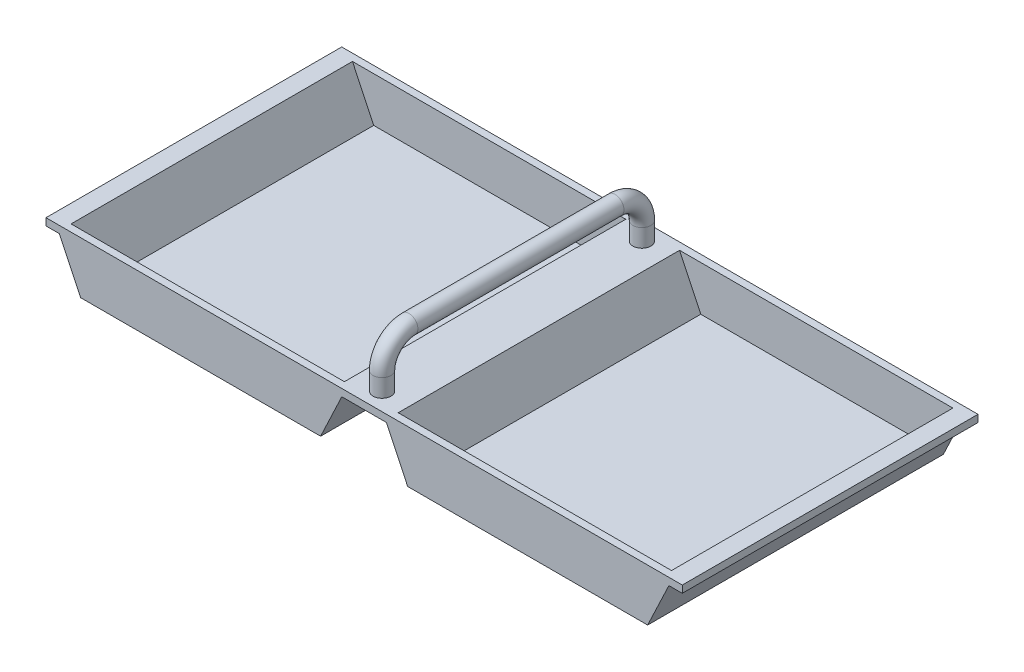
ISO-10303-21;
HEADER;
FILE_DESCRIPTION(('STEP AP214'),'2;1');
FILE_NAME('part.step','',(''),(''),'','','');
FILE_SCHEMA(('AUTOMOTIVE_DESIGN { 1 0 10303 214 1 1 1 1 }'));
ENDSEC;
DATA;
#1=APPLICATION_CONTEXT('core data for automotive mechanical design processes');
#2=APPLICATION_PROTOCOL_DEFINITION('international standard','automotive_design',2000,#1);
#3=PRODUCT_CONTEXT('',#1,'mechanical');
#4=PRODUCT('Part','Part','',(#3));
#5=PRODUCT_RELATED_PRODUCT_CATEGORY('part','',(#4));
#6=PRODUCT_DEFINITION_FORMATION('','',#4);
#7=PRODUCT_DEFINITION_CONTEXT('part definition',#1,'design');
#8=PRODUCT_DEFINITION('design','',#6,#7);
#9=PRODUCT_DEFINITION_SHAPE('','',#8);
#10=(LENGTH_UNIT() NAMED_UNIT(*) SI_UNIT(.MILLI.,.METRE.));
#11=(NAMED_UNIT(*) PLANE_ANGLE_UNIT() SI_UNIT($,.RADIAN.));
#12=(NAMED_UNIT(*) SI_UNIT($,.STERADIAN.) SOLID_ANGLE_UNIT());
#13=UNCERTAINTY_MEASURE_WITH_UNIT(LENGTH_MEASURE(1.E-05),#10,'distance_accuracy_value','');
#14=(GEOMETRIC_REPRESENTATION_CONTEXT(3) GLOBAL_UNCERTAINTY_ASSIGNED_CONTEXT((#13)) GLOBAL_UNIT_ASSIGNED_CONTEXT((#10,
#11,#12)) REPRESENTATION_CONTEXT('',''));
#15=CARTESIAN_POINT('',(0.,0.,0.));
#16=DIRECTION('',(0.,0.,1.));
#17=DIRECTION('',(1.,0.,0.));
#18=AXIS2_PLACEMENT_3D('',#15,#16,#17);
#19=CARTESIAN_POINT('',(167.5,-4.,78.5));
#20=DIRECTION('',(0.,1.,0.));
#21=DIRECTION('',(0.,0.,1.));
#22=AXIS2_PLACEMENT_3D('',#19,#20,#21);
#23=PLANE('',#22);
#24=DIRECTION('',(0.,0.,-1.));
#25=VECTOR('',#24,1.);
#26=CARTESIAN_POINT('',(170.031231051336,-4.,78.5));
#27=LINE('',#26,#25);
#28=CARTESIAN_POINT('',(170.031231051336,-4.,82.5));
#29=VERTEX_POINT('',#28);
#30=CARTESIAN_POINT('',(170.031231051336,-4.,-82.5));
#31=VERTEX_POINT('',#30);
#32=EDGE_CURVE('E109',#29,#31,#27,.T.);
#33=ORIENTED_EDGE('',*,*,#32,.T.);
#34=DIRECTION('',(-1.,0.,0.));
#35=VECTOR('',#34,1.);
#36=CARTESIAN_POINT('',(177.5,-4.,-82.5));
#37=LINE('',#36,#35);
#38=CARTESIAN_POINT('',(177.5,-4.,-82.5));
#39=VERTEX_POINT('',#38);
#40=EDGE_CURVE('E178',#39,#31,#37,.T.);
#41=ORIENTED_EDGE('',*,*,#40,.F.);
#42=DIRECTION('',(0.,0.,-1.));
#43=VECTOR('',#42,1.);
#44=CARTESIAN_POINT('',(177.5,-4.,78.5));
#45=LINE('',#44,#43);
#46=CARTESIAN_POINT('',(177.5,-4.,82.5));
#47=VERTEX_POINT('',#46);
#48=EDGE_CURVE('E11',#47,#39,#45,.T.);
#49=ORIENTED_EDGE('',*,*,#48,.F.);
#50=DIRECTION('',(1.,0.,0.));
#51=VECTOR('',#50,1.);
#52=CARTESIAN_POINT('',(177.5,-4.,82.5));
#53=LINE('',#52,#51);
#54=EDGE_CURVE('E247',#29,#47,#53,.T.);
#55=ORIENTED_EDGE('',*,*,#54,.F.);
#56=EDGE_LOOP('',(#33,#41,#49,#55));
#57=FACE_BOUND('',#56,.T.);
#58=ADVANCED_FACE('F37',(#57),#23,.F.);
#59=CARTESIAN_POINT('',(177.5,0.,78.5));
#60=DIRECTION('',(1.,0.,0.));
#61=DIRECTION('',(0.,0.,-1.));
#62=AXIS2_PLACEMENT_3D('',#59,#60,#61);
#63=PLANE('',#62);
#64=ORIENTED_EDGE('',*,*,#48,.T.);
#65=DIRECTION('',(0.,-1.,0.));
#66=VECTOR('',#65,1.);
#67=CARTESIAN_POINT('',(177.5,0.,-82.5));
#68=LINE('',#67,#66);
#69=CARTESIAN_POINT('',(177.5,0.,-82.5));
#70=VERTEX_POINT('',#69);
#71=EDGE_CURVE('E172',#70,#39,#68,.T.);
#72=ORIENTED_EDGE('',*,*,#71,.F.);
#73=DIRECTION('',(0.,0.,-1.));
#74=VECTOR('',#73,1.);
#75=CARTESIAN_POINT('',(177.5,0.,78.5));
#76=LINE('',#75,#74);
#77=CARTESIAN_POINT('',(177.5,0.,82.5));
#78=VERTEX_POINT('',#77);
#79=EDGE_CURVE('E45',#78,#70,#76,.T.);
#80=ORIENTED_EDGE('',*,*,#79,.F.);
#81=DIRECTION('',(0.,1.,0.));
#82=VECTOR('',#81,1.);
#83=CARTESIAN_POINT('',(177.5,0.,82.5));
#84=LINE('',#83,#82);
#85=EDGE_CURVE('E250',#47,#78,#84,.T.);
#86=ORIENTED_EDGE('',*,*,#85,.F.);
#87=EDGE_LOOP('',(#64,#72,#80,#86));
#88=FACE_BOUND('',#87,.T.);
#89=ADVANCED_FACE('F173',(#88),#63,.T.);
#90=CARTESIAN_POINT('',(167.5,0.,78.5));
#91=DIRECTION('',(-0.903723405746344,0.428116813388857,0.));
#92=DIRECTION('',(-0.428116813388857,-0.903723405746344,0.));
#93=AXIS2_PLACEMENT_3D('',#90,#91,#92);
#94=PLANE('',#93);
#95=DIRECTION('',(0.428116813388857,0.903723405746343,0.));
#96=VECTOR('',#95,1.);
#97=CARTESIAN_POINT('',(167.5,0.,-78.5));
#98=LINE('',#97,#96);
#99=CARTESIAN_POINT('',(155.656862745098,-25.,-78.5));
#100=VERTEX_POINT('',#99);
#101=CARTESIAN_POINT('',(167.5,0.,-78.5));
#102=VERTEX_POINT('',#101);
#103=EDGE_CURVE('E253',#100,#102,#98,.T.);
#104=ORIENTED_EDGE('',*,*,#103,.F.);
#105=DIRECTION('',(0.,0.,-1.));
#106=VECTOR('',#105,1.);
#107=CARTESIAN_POINT('',(155.656862745098,-25.,78.5));
#108=LINE('',#107,#106);
#109=CARTESIAN_POINT('',(155.656862745098,-25.,78.5));
#110=VERTEX_POINT('',#109);
#111=EDGE_CURVE('E147',#110,#100,#108,.T.);
#112=ORIENTED_EDGE('',*,*,#111,.F.);
#113=DIRECTION('',(0.428116813388857,0.903723405746343,0.));
#114=VECTOR('',#113,1.);
#115=CARTESIAN_POINT('',(167.5,0.,78.5));
#116=LINE('',#115,#114);
#117=CARTESIAN_POINT('',(167.5,0.,78.5));
#118=VERTEX_POINT('',#117);
#119=EDGE_CURVE('E102',#110,#118,#116,.T.);
#120=ORIENTED_EDGE('',*,*,#119,.T.);
#121=DIRECTION('',(0.,0.,-1.));
#122=VECTOR('',#121,1.);
#123=CARTESIAN_POINT('',(167.5,0.,78.5));
#124=LINE('',#123,#122);
#125=EDGE_CURVE('E149',#118,#102,#124,.T.);
#126=ORIENTED_EDGE('',*,*,#125,.T.);
#127=EDGE_LOOP('',(#104,#112,#120,#126));
#128=FACE_BOUND('',#127,.T.);
#129=ADVANCED_FACE('F300',(#128),#94,.T.);
#130=CARTESIAN_POINT('',(155.656862745098,-25.,78.5));
#131=DIRECTION('',(0.,1.,0.));
#132=DIRECTION('',(0.,0.,1.));
#133=AXIS2_PLACEMENT_3D('',#130,#131,#132);
#134=PLANE('',#133);
#135=DIRECTION('',(1.,0.,0.));
#136=VECTOR('',#135,1.);
#137=CARTESIAN_POINT('',(155.656862745098,-25.,-78.5));
#138=LINE('',#137,#136);
#139=CARTESIAN_POINT('',(26.816862745098,-25.,-78.5));
#140=VERTEX_POINT('',#139);
#141=EDGE_CURVE('E268',#140,#100,#138,.T.);
#142=ORIENTED_EDGE('',*,*,#141,.F.);
#143=DIRECTION('',(0.,0.,-1.));
#144=VECTOR('',#143,1.);
#145=CARTESIAN_POINT('',(26.816862745098,-25.,78.5));
#146=LINE('',#145,#144);
#147=CARTESIAN_POINT('',(26.816862745098,-25.,78.5));
#148=VERTEX_POINT('',#147);
#149=EDGE_CURVE('E145',#148,#140,#146,.T.);
#150=ORIENTED_EDGE('',*,*,#149,.F.);
#151=DIRECTION('',(1.,0.,0.));
#152=VECTOR('',#151,1.);
#153=CARTESIAN_POINT('',(155.656862745098,-25.,78.5));
#154=LINE('',#153,#152);
#155=EDGE_CURVE('E105',#148,#110,#154,.T.);
#156=ORIENTED_EDGE('',*,*,#155,.T.);
#157=ORIENTED_EDGE('',*,*,#111,.T.);
#158=EDGE_LOOP('',(#142,#150,#156,#157));
#159=FACE_BOUND('',#158,.T.);
#160=ADVANCED_FACE('F303',(#159),#134,.T.);
#161=CARTESIAN_POINT('',(26.816862745098,-25.,78.5));
#162=DIRECTION('',(0.904090697042424,0.427340627042812,0.));
#163=DIRECTION('',(-0.427340627042812,0.904090697042424,0.));
#164=AXIS2_PLACEMENT_3D('',#161,#162,#163);
#165=PLANE('',#164);
#166=DIRECTION('',(0.427340627042812,-0.904090697042424,0.));
#167=VECTOR('',#166,1.);
#168=CARTESIAN_POINT('',(26.816862745098,-25.,-78.5));
#169=LINE('',#168,#167);
#170=CARTESIAN_POINT('',(15.,0.,-78.5));
#171=VERTEX_POINT('',#170);
#172=EDGE_CURVE('E271',#171,#140,#169,.T.);
#173=ORIENTED_EDGE('',*,*,#172,.F.);
#174=DIRECTION('',(0.,0.,-1.));
#175=VECTOR('',#174,1.);
#176=CARTESIAN_POINT('',(15.,0.,78.5));
#177=LINE('',#176,#175);
#178=CARTESIAN_POINT('',(15.,0.,78.5));
#179=VERTEX_POINT('',#178);
#180=EDGE_CURVE('E143',#179,#171,#177,.T.);
#181=ORIENTED_EDGE('',*,*,#180,.F.);
#182=DIRECTION('',(0.427340627042812,-0.904090697042424,0.));
#183=VECTOR('',#182,1.);
#184=CARTESIAN_POINT('',(26.816862745098,-25.,78.5));
#185=LINE('',#184,#183);
#186=EDGE_CURVE('E258',#179,#148,#185,.T.);
#187=ORIENTED_EDGE('',*,*,#186,.T.);
#188=ORIENTED_EDGE('',*,*,#149,.T.);
#189=EDGE_LOOP('',(#173,#181,#187,#188));
#190=FACE_BOUND('',#189,.T.);
#191=ADVANCED_FACE('F307',(#190),#165,.T.);
#192=CARTESIAN_POINT('',(-26.816862745098,-25.,78.5));
#193=DIRECTION('',(-0.904090697042424,0.427340627042812,0.));
#194=DIRECTION('',(-0.427340627042812,-0.904090697042424,0.));
#195=AXIS2_PLACEMENT_3D('',#192,#193,#194);
#196=PLANE('',#195);
#197=DIRECTION('',(0.427340627042812,0.904090697042424,0.));
#198=VECTOR('',#197,1.);
#199=CARTESIAN_POINT('',(-26.816862745098,-25.,-78.5));
#200=LINE('',#199,#198);
#201=CARTESIAN_POINT('',(-26.816862745098,-25.,-78.5));
#202=VERTEX_POINT('',#201);
#203=CARTESIAN_POINT('',(-15.,0.,-78.5));
#204=VERTEX_POINT('',#203);
#205=EDGE_CURVE('E97',#202,#204,#200,.T.);
#206=ORIENTED_EDGE('',*,*,#205,.F.);
#207=DIRECTION('',(0.,0.,-1.));
#208=VECTOR('',#207,1.);
#209=CARTESIAN_POINT('',(-26.816862745098,-25.,78.5));
#210=LINE('',#209,#208);
#211=CARTESIAN_POINT('',(-26.816862745098,-25.,78.5));
#212=VERTEX_POINT('',#211);
#213=EDGE_CURVE('E87',#212,#202,#210,.T.);
#214=ORIENTED_EDGE('',*,*,#213,.F.);
#215=DIRECTION('',(0.427340627042812,0.904090697042424,0.));
#216=VECTOR('',#215,1.);
#217=CARTESIAN_POINT('',(-26.816862745098,-25.,78.5));
#218=LINE('',#217,#216);
#219=CARTESIAN_POINT('',(-15.,0.,78.5));
#220=VERTEX_POINT('',#219);
#221=EDGE_CURVE('E261',#212,#220,#218,.T.);
#222=ORIENTED_EDGE('',*,*,#221,.T.);
#223=DIRECTION('',(0.,0.,-1.));
#224=VECTOR('',#223,1.);
#225=CARTESIAN_POINT('',(-15.,0.,78.5));
#226=LINE('',#225,#224);
#227=EDGE_CURVE('E141',#220,#204,#226,.T.);
#228=ORIENTED_EDGE('',*,*,#227,.T.);
#229=EDGE_LOOP('',(#206,#214,#222,#228));
#230=FACE_BOUND('',#229,.T.);
#231=ADVANCED_FACE('F443',(#230),#196,.T.);
#232=CARTESIAN_POINT('',(-155.656862745098,-25.,78.5));
#233=DIRECTION('',(0.,1.,0.));
#234=DIRECTION('',(0.,0.,1.));
#235=AXIS2_PLACEMENT_3D('',#232,#233,#234);
#236=PLANE('',#235);
#237=DIRECTION('',(1.,0.,0.));
#238=VECTOR('',#237,1.);
#239=CARTESIAN_POINT('',(-155.656862745098,-25.,-78.5));
#240=LINE('',#239,#238);
#241=CARTESIAN_POINT('',(-155.656862745098,-25.,-78.5));
#242=VERTEX_POINT('',#241);
#243=EDGE_CURVE('E91',#242,#202,#240,.T.);
#244=ORIENTED_EDGE('',*,*,#243,.F.);
#245=DIRECTION('',(0.,0.,-1.));
#246=VECTOR('',#245,1.);
#247=CARTESIAN_POINT('',(-155.656862745098,-25.,78.5));
#248=LINE('',#247,#246);
#249=CARTESIAN_POINT('',(-155.656862745098,-25.,78.5));
#250=VERTEX_POINT('',#249);
#251=EDGE_CURVE('E78',#250,#242,#248,.T.);
#252=ORIENTED_EDGE('',*,*,#251,.F.);
#253=DIRECTION('',(1.,0.,0.));
#254=VECTOR('',#253,1.);
#255=CARTESIAN_POINT('',(-155.656862745098,-25.,78.5));
#256=LINE('',#255,#254);
#257=EDGE_CURVE('E52',#250,#212,#256,.T.);
#258=ORIENTED_EDGE('',*,*,#257,.T.);
#259=ORIENTED_EDGE('',*,*,#213,.T.);
#260=EDGE_LOOP('',(#244,#252,#258,#259));
#261=FACE_BOUND('',#260,.T.);
#262=ADVANCED_FACE('F92',(#261),#236,.T.);
#263=CARTESIAN_POINT('',(-167.5,0.,78.5));
#264=DIRECTION('',(0.903723405746344,0.428116813388857,0.));
#265=DIRECTION('',(-0.428116813388857,0.903723405746344,0.));
#266=AXIS2_PLACEMENT_3D('',#263,#264,#265);
#267=PLANE('',#266);
#268=DIRECTION('',(0.428116813388857,-0.903723405746343,0.));
#269=VECTOR('',#268,1.);
#270=CARTESIAN_POINT('',(-167.5,0.,-78.5));
#271=LINE('',#270,#269);
#272=CARTESIAN_POINT('',(-167.5,0.,-78.5));
#273=VERTEX_POINT('',#272);
#274=EDGE_CURVE('E83',#273,#242,#271,.T.);
#275=ORIENTED_EDGE('',*,*,#274,.F.);
#276=DIRECTION('',(0.,0.,-1.));
#277=VECTOR('',#276,1.);
#278=CARTESIAN_POINT('',(-167.5,0.,78.5));
#279=LINE('',#278,#277);
#280=CARTESIAN_POINT('',(-167.5,0.,78.5));
#281=VERTEX_POINT('',#280);
#282=EDGE_CURVE('E88',#281,#273,#279,.T.);
#283=ORIENTED_EDGE('',*,*,#282,.F.);
#284=DIRECTION('',(0.428116813388857,-0.903723405746343,0.));
#285=VECTOR('',#284,1.);
#286=CARTESIAN_POINT('',(-167.5,0.,78.5));
#287=LINE('',#286,#285);
#288=EDGE_CURVE('E85',#281,#250,#287,.T.);
#289=ORIENTED_EDGE('',*,*,#288,.T.);
#290=ORIENTED_EDGE('',*,*,#251,.T.);
#291=EDGE_LOOP('',(#275,#283,#289,#290));
#292=FACE_BOUND('',#291,.T.);
#293=ADVANCED_FACE('F80',(#292),#267,.T.);
#294=CARTESIAN_POINT('',(-177.5,0.,78.5));
#295=DIRECTION('',(0.,1.,0.));
#296=DIRECTION('',(0.,0.,1.));
#297=AXIS2_PLACEMENT_3D('',#294,#295,#296);
#298=PLANE('',#297);
#299=CARTESIAN_POINT('',(0.,0.,-72.5));
#300=DIRECTION('',(0.,1.,0.));
#301=DIRECTION('',(1.,0.,0.));
#302=AXIS2_PLACEMENT_3D('',#299,#300,#301);
#303=CIRCLE('',#302,5.);
#304=CARTESIAN_POINT('',(5.,0.,-72.5));
#305=VERTEX_POINT('',#304);
#306=EDGE_CURVE('E609',#305,#305,#303,.F.);
#307=ORIENTED_EDGE('',*,*,#306,.T.);
#308=EDGE_LOOP('',(#307));
#309=FACE_BOUND('',#308,.T.);
#310=CARTESIAN_POINT('',(0.,0.,72.5));
#311=DIRECTION('',(0.,-1.,0.));
#312=DIRECTION('',(1.,0.,0.));
#313=AXIS2_PLACEMENT_3D('',#310,#311,#312);
#314=CIRCLE('',#313,5.);
#315=CARTESIAN_POINT('',(5.,0.,72.5));
#316=VERTEX_POINT('',#315);
#317=EDGE_CURVE('E611',#316,#316,#314,.T.);
#318=ORIENTED_EDGE('',*,*,#317,.T.);
#319=EDGE_LOOP('',(#318));
#320=FACE_BOUND('',#319,.T.);
#321=ORIENTED_EDGE('',*,*,#282,.T.);
#322=DIRECTION('',(1.,0.,0.));
#323=VECTOR('',#322,1.);
#324=CARTESIAN_POINT('',(-177.5,0.,-78.5));
#325=LINE('',#324,#323);
#326=EDGE_CURVE('E101',#273,#204,#325,.T.);
#327=ORIENTED_EDGE('',*,*,#326,.T.);
#328=ORIENTED_EDGE('',*,*,#227,.F.);
#329=DIRECTION('',(-1.,0.,0.));
#330=VECTOR('',#329,1.);
#331=CARTESIAN_POINT('',(-177.5,0.,78.5));
#332=LINE('',#331,#330);
#333=EDGE_CURVE('E216',#220,#281,#332,.T.);
#334=ORIENTED_EDGE('',*,*,#333,.T.);
#335=EDGE_LOOP('',(#321,#327,#328,#334));
#336=FACE_BOUND('',#335,.T.);
#337=ORIENTED_EDGE('',*,*,#180,.T.);
#338=EDGE_CURVE('E186',#171,#102,#325,.T.);
#339=ORIENTED_EDGE('',*,*,#338,.T.);
#340=ORIENTED_EDGE('',*,*,#125,.F.);
#341=EDGE_CURVE('E223',#118,#179,#332,.T.);
#342=ORIENTED_EDGE('',*,*,#341,.T.);
#343=EDGE_LOOP('',(#337,#339,#340,#342));
#344=FACE_BOUND('',#343,.T.);
#345=DIRECTION('',(1.,0.,0.));
#346=VECTOR('',#345,1.);
#347=CARTESIAN_POINT('',(-177.5,0.,-82.5));
#348=LINE('',#347,#346);
#349=CARTESIAN_POINT('',(-177.5,0.,-82.5));
#350=VERTEX_POINT('',#349);
#351=EDGE_CURVE('E162',#350,#70,#348,.T.);
#352=ORIENTED_EDGE('',*,*,#351,.F.);
#353=DIRECTION('',(0.,0.,-1.));
#354=VECTOR('',#353,1.);
#355=CARTESIAN_POINT('',(-177.5,0.,78.5));
#356=LINE('',#355,#354);
#357=CARTESIAN_POINT('',(-177.5,0.,82.5));
#358=VERTEX_POINT('',#357);
#359=EDGE_CURVE('E136',#358,#350,#356,.T.);
#360=ORIENTED_EDGE('',*,*,#359,.F.);
#361=DIRECTION('',(-1.,0.,0.));
#362=VECTOR('',#361,1.);
#363=CARTESIAN_POINT('',(-177.5,0.,82.5));
#364=LINE('',#363,#362);
#365=EDGE_CURVE('E165',#78,#358,#364,.T.);
#366=ORIENTED_EDGE('',*,*,#365,.F.);
#367=ORIENTED_EDGE('',*,*,#79,.T.);
#368=EDGE_LOOP('',(#352,#360,#366,#367));
#369=FACE_BOUND('',#368,.T.);
#370=ADVANCED_FACE('F158',(#309,#320,#336,#344,#369),#298,.T.);
#371=CARTESIAN_POINT('',(-177.5,-4.,78.5));
#372=DIRECTION('',(-1.,0.,0.));
#373=DIRECTION('',(0.,0.,1.));
#374=AXIS2_PLACEMENT_3D('',#371,#372,#373);
#375=PLANE('',#374);
#376=ORIENTED_EDGE('',*,*,#359,.T.);
#377=DIRECTION('',(0.,1.,0.));
#378=VECTOR('',#377,1.);
#379=CARTESIAN_POINT('',(-177.5,-4.,-82.5));
#380=LINE('',#379,#378);
#381=CARTESIAN_POINT('',(-177.5,-4.,-82.5));
#382=VERTEX_POINT('',#381);
#383=EDGE_CURVE('E184',#382,#350,#380,.T.);
#384=ORIENTED_EDGE('',*,*,#383,.F.);
#385=DIRECTION('',(0.,0.,-1.));
#386=VECTOR('',#385,1.);
#387=CARTESIAN_POINT('',(-177.5,-4.,78.5));
#388=LINE('',#387,#386);
#389=CARTESIAN_POINT('',(-177.5,-4.,82.5));
#390=VERTEX_POINT('',#389);
#391=EDGE_CURVE('E133',#390,#382,#388,.T.);
#392=ORIENTED_EDGE('',*,*,#391,.F.);
#393=DIRECTION('',(0.,-1.,0.));
#394=VECTOR('',#393,1.);
#395=CARTESIAN_POINT('',(-177.5,-4.,82.5));
#396=LINE('',#395,#394);
#397=EDGE_CURVE('E219',#358,#390,#396,.T.);
#398=ORIENTED_EDGE('',*,*,#397,.F.);
#399=EDGE_LOOP('',(#376,#384,#392,#398));
#400=FACE_BOUND('',#399,.T.);
#401=ADVANCED_FACE('F379',(#400),#375,.T.);
#402=CARTESIAN_POINT('',(-177.5,-4.,78.5));
#403=DIRECTION('',(0.,1.,0.));
#404=DIRECTION('',(0.,0.,1.));
#405=AXIS2_PLACEMENT_3D('',#402,#403,#404);
#406=PLANE('',#405);
#407=ORIENTED_EDGE('',*,*,#391,.T.);
#408=DIRECTION('',(-1.,0.,0.));
#409=VECTOR('',#408,1.);
#410=CARTESIAN_POINT('',(-170.031231051336,-4.,-82.5));
#411=LINE('',#410,#409);
#412=CARTESIAN_POINT('',(-170.031231051336,-4.,-82.5));
#413=VERTEX_POINT('',#412);
#414=EDGE_CURVE('E214',#413,#382,#411,.T.);
#415=ORIENTED_EDGE('',*,*,#414,.F.);
#416=DIRECTION('',(0.,0.,-1.));
#417=VECTOR('',#416,1.);
#418=CARTESIAN_POINT('',(-170.031231051336,-4.,78.5));
#419=LINE('',#418,#417);
#420=CARTESIAN_POINT('',(-170.031231051336,-4.,82.5));
#421=VERTEX_POINT('',#420);
#422=EDGE_CURVE('E130',#421,#413,#419,.T.);
#423=ORIENTED_EDGE('',*,*,#422,.F.);
#424=DIRECTION('',(1.,0.,0.));
#425=VECTOR('',#424,1.);
#426=CARTESIAN_POINT('',(-170.031231051336,-4.,82.5));
#427=LINE('',#426,#425);
#428=EDGE_CURVE('E222',#390,#421,#427,.T.);
#429=ORIENTED_EDGE('',*,*,#428,.F.);
#430=EDGE_LOOP('',(#407,#415,#423,#429));
#431=FACE_BOUND('',#430,.T.);
#432=ADVANCED_FACE('F387',(#431),#406,.F.);
#433=CARTESIAN_POINT('',(-171.114893622985,-1.71246725355543,78.5));
#434=DIRECTION('',(0.903723405746344,0.428116813388857,0.));
#435=DIRECTION('',(-0.428116813388857,0.903723405746344,0.));
#436=AXIS2_PLACEMENT_3D('',#433,#434,#435);
#437=PLANE('',#436);
#438=ORIENTED_EDGE('',*,*,#422,.T.);
#439=DIRECTION('',(-0.428116813388857,0.903723405746344,0.));
#440=VECTOR('',#439,1.);
#441=CARTESIAN_POINT('',(-158.188093796434,-29.,-82.5));
#442=LINE('',#441,#440);
#443=CARTESIAN_POINT('',(-158.188093796434,-29.,-82.5));
#444=VERTEX_POINT('',#443);
#445=EDGE_CURVE('E211',#444,#413,#442,.T.);
#446=ORIENTED_EDGE('',*,*,#445,.F.);
#447=DIRECTION('',(0.,0.,-1.));
#448=VECTOR('',#447,1.);
#449=CARTESIAN_POINT('',(-158.188093796434,-29.,78.5));
#450=LINE('',#449,#448);
#451=CARTESIAN_POINT('',(-158.188093796434,-29.,82.5));
#452=VERTEX_POINT('',#451);
#453=EDGE_CURVE('E127',#452,#444,#450,.T.);
#454=ORIENTED_EDGE('',*,*,#453,.F.);
#455=DIRECTION('',(0.428116813388857,-0.903723405746344,0.));
#456=VECTOR('',#455,1.);
#457=CARTESIAN_POINT('',(-158.188093796434,-29.,82.5));
#458=LINE('',#457,#456);
#459=EDGE_CURVE('E226',#421,#452,#458,.T.);
#460=ORIENTED_EDGE('',*,*,#459,.F.);
#461=EDGE_LOOP('',(#438,#446,#454,#460));
#462=FACE_BOUND('',#461,.T.);
#463=ADVANCED_FACE('F394',(#462),#437,.F.);
#464=CARTESIAN_POINT('',(-155.656862745098,-29.,78.5));
#465=DIRECTION('',(0.,1.,0.));
#466=DIRECTION('',(0.,0.,1.));
#467=AXIS2_PLACEMENT_3D('',#464,#465,#466);
#468=PLANE('',#467);
#469=ORIENTED_EDGE('',*,*,#453,.T.);
#470=DIRECTION('',(-1.,0.,0.));
#471=VECTOR('',#470,1.);
#472=CARTESIAN_POINT('',(-24.2832259105169,-29.,-82.5));
#473=LINE('',#472,#471);
#474=CARTESIAN_POINT('',(-24.2832259105169,-29.,-82.5));
#475=VERTEX_POINT('',#474);
#476=EDGE_CURVE('E208',#475,#444,#473,.T.);
#477=ORIENTED_EDGE('',*,*,#476,.F.);
#478=DIRECTION('',(0.,0.,-1.));
#479=VECTOR('',#478,1.);
#480=CARTESIAN_POINT('',(-24.2832259105169,-29.,78.5));
#481=LINE('',#480,#479);
#482=CARTESIAN_POINT('',(-24.2832259105169,-29.,82.5));
#483=VERTEX_POINT('',#482);
#484=EDGE_CURVE('E124',#483,#475,#481,.T.);
#485=ORIENTED_EDGE('',*,*,#484,.F.);
#486=DIRECTION('',(1.,0.,0.));
#487=VECTOR('',#486,1.);
#488=CARTESIAN_POINT('',(-24.2832259105169,-29.,82.5));
#489=LINE('',#488,#487);
#490=EDGE_CURVE('E229',#452,#483,#489,.T.);
#491=ORIENTED_EDGE('',*,*,#490,.F.);
#492=EDGE_LOOP('',(#469,#477,#485,#491));
#493=FACE_BOUND('',#492,.T.);
#494=ADVANCED_FACE('F401',(#493),#468,.F.);
#495=CARTESIAN_POINT('',(-23.2004999569283,-26.7093625081712,78.5));
#496=DIRECTION('',(-0.904090697042424,0.427340627042812,0.));
#497=DIRECTION('',(-0.427340627042812,-0.904090697042425,0.));
#498=AXIS2_PLACEMENT_3D('',#495,#496,#497);
#499=PLANE('',#498);
#500=ORIENTED_EDGE('',*,*,#484,.T.);
#501=DIRECTION('',(-0.427340627042811,-0.904090697042425,0.));
#502=VECTOR('',#501,1.);
#503=CARTESIAN_POINT('',(-12.4663631654189,-4.,-82.5));
#504=LINE('',#503,#502);
#505=CARTESIAN_POINT('',(-12.4663631654189,-4.,-82.5));
#506=VERTEX_POINT('',#505);
#507=EDGE_CURVE('E205',#506,#475,#504,.T.);
#508=ORIENTED_EDGE('',*,*,#507,.F.);
#509=DIRECTION('',(0.,0.,-1.));
#510=VECTOR('',#509,1.);
#511=CARTESIAN_POINT('',(-12.4663631654189,-4.,78.5));
#512=LINE('',#511,#510);
#513=CARTESIAN_POINT('',(-12.4663631654189,-4.,82.5));
#514=VERTEX_POINT('',#513);
#515=EDGE_CURVE('E121',#514,#506,#512,.T.);
#516=ORIENTED_EDGE('',*,*,#515,.F.);
#517=DIRECTION('',(0.427340627042811,0.904090697042425,0.));
#518=VECTOR('',#517,1.);
#519=CARTESIAN_POINT('',(-12.4663631654189,-4.,82.5));
#520=LINE('',#519,#518);
#521=EDGE_CURVE('E232',#483,#514,#520,.T.);
#522=ORIENTED_EDGE('',*,*,#521,.F.);
#523=EDGE_LOOP('',(#500,#508,#516,#522));
#524=FACE_BOUND('',#523,.T.);
#525=ADVANCED_FACE('F409',(#524),#499,.F.);
#526=CARTESIAN_POINT('',(-15.,-4.,78.5));
#527=DIRECTION('',(0.,1.,0.));
#528=DIRECTION('',(0.,0.,1.));
#529=AXIS2_PLACEMENT_3D('',#526,#527,#528);
#530=PLANE('',#529);
#531=ORIENTED_EDGE('',*,*,#515,.T.);
#532=DIRECTION('',(-1.,0.,0.));
#533=VECTOR('',#532,1.);
#534=CARTESIAN_POINT('',(12.4663631654189,-3.99999999999999,-82.5));
#535=LINE('',#534,#533);
#536=CARTESIAN_POINT('',(12.4663631654189,-3.99999999999999,-82.5));
#537=VERTEX_POINT('',#536);
#538=EDGE_CURVE('E202',#537,#506,#535,.T.);
#539=ORIENTED_EDGE('',*,*,#538,.F.);
#540=DIRECTION('',(0.,0.,-1.));
#541=VECTOR('',#540,1.);
#542=CARTESIAN_POINT('',(12.4663631654189,-3.99999999999999,78.5));
#543=LINE('',#542,#541);
#544=CARTESIAN_POINT('',(12.4663631654189,-3.99999999999999,82.5));
#545=VERTEX_POINT('',#544);
#546=EDGE_CURVE('E118',#545,#537,#543,.T.);
#547=ORIENTED_EDGE('',*,*,#546,.F.);
#548=DIRECTION('',(1.,0.,0.));
#549=VECTOR('',#548,1.);
#550=CARTESIAN_POINT('',(12.4663631654189,-3.99999999999999,82.5));
#551=LINE('',#550,#549);
#552=EDGE_CURVE('E235',#514,#545,#551,.T.);
#553=ORIENTED_EDGE('',*,*,#552,.F.);
#554=EDGE_LOOP('',(#531,#539,#547,#553));
#555=FACE_BOUND('',#554,.T.);
#556=ADVANCED_FACE('F417',(#555),#530,.F.);
#557=CARTESIAN_POINT('',(23.2004999569283,-26.7093625081712,78.5));
#558=DIRECTION('',(0.904090697042424,0.427340627042812,0.));
#559=DIRECTION('',(-0.427340627042812,0.904090697042425,0.));
#560=AXIS2_PLACEMENT_3D('',#557,#558,#559);
#561=PLANE('',#560);
#562=ORIENTED_EDGE('',*,*,#546,.T.);
#563=DIRECTION('',(-0.427340627042811,0.904090697042425,0.));
#564=VECTOR('',#563,1.);
#565=CARTESIAN_POINT('',(24.2832259105169,-29.,-82.5));
#566=LINE('',#565,#564);
#567=CARTESIAN_POINT('',(24.2832259105169,-29.,-82.5));
#568=VERTEX_POINT('',#567);
#569=EDGE_CURVE('E199',#568,#537,#566,.T.);
#570=ORIENTED_EDGE('',*,*,#569,.F.);
#571=DIRECTION('',(0.,0.,-1.));
#572=VECTOR('',#571,1.);
#573=CARTESIAN_POINT('',(24.2832259105169,-29.,78.5));
#574=LINE('',#573,#572);
#575=CARTESIAN_POINT('',(24.2832259105169,-29.,82.5));
#576=VERTEX_POINT('',#575);
#577=EDGE_CURVE('E115',#576,#568,#574,.T.);
#578=ORIENTED_EDGE('',*,*,#577,.F.);
#579=DIRECTION('',(0.427340627042811,-0.904090697042425,0.));
#580=VECTOR('',#579,1.);
#581=CARTESIAN_POINT('',(24.2832259105169,-29.,82.5));
#582=LINE('',#581,#580);
#583=EDGE_CURVE('E238',#545,#576,#582,.T.);
#584=ORIENTED_EDGE('',*,*,#583,.F.);
#585=EDGE_LOOP('',(#562,#570,#578,#584));
#586=FACE_BOUND('',#585,.T.);
#587=ADVANCED_FACE('F359',(#586),#561,.F.);
#588=CARTESIAN_POINT('',(155.656862745098,-29.,78.5));
#589=DIRECTION('',(0.,1.,0.));
#590=DIRECTION('',(0.,0.,1.));
#591=AXIS2_PLACEMENT_3D('',#588,#589,#590);
#592=PLANE('',#591);
#593=ORIENTED_EDGE('',*,*,#577,.T.);
#594=DIRECTION('',(-1.,0.,0.));
#595=VECTOR('',#594,1.);
#596=CARTESIAN_POINT('',(158.188093796434,-29.,-82.5));
#597=LINE('',#596,#595);
#598=CARTESIAN_POINT('',(158.188093796434,-29.,-82.5));
#599=VERTEX_POINT('',#598);
#600=EDGE_CURVE('E196',#599,#568,#597,.T.);
#601=ORIENTED_EDGE('',*,*,#600,.F.);
#602=DIRECTION('',(0.,0.,-1.));
#603=VECTOR('',#602,1.);
#604=CARTESIAN_POINT('',(158.188093796434,-29.,78.5));
#605=LINE('',#604,#603);
#606=CARTESIAN_POINT('',(158.188093796434,-29.,82.5));
#607=VERTEX_POINT('',#606);
#608=EDGE_CURVE('E112',#607,#599,#605,.T.);
#609=ORIENTED_EDGE('',*,*,#608,.F.);
#610=DIRECTION('',(1.,0.,0.));
#611=VECTOR('',#610,1.);
#612=CARTESIAN_POINT('',(158.188093796434,-29.,82.5));
#613=LINE('',#612,#611);
#614=EDGE_CURVE('E241',#576,#607,#613,.T.);
#615=ORIENTED_EDGE('',*,*,#614,.F.);
#616=EDGE_LOOP('',(#593,#601,#609,#615));
#617=FACE_BOUND('',#616,.T.);
#618=ADVANCED_FACE('F349',(#617),#592,.F.);
#619=CARTESIAN_POINT('',(171.114893622985,-1.71246725355543,78.5));
#620=DIRECTION('',(-0.903723405746344,0.428116813388857,0.));
#621=DIRECTION('',(-0.428116813388857,-0.903723405746344,0.));
#622=AXIS2_PLACEMENT_3D('',#619,#620,#621);
#623=PLANE('',#622);
#624=ORIENTED_EDGE('',*,*,#608,.T.);
#625=DIRECTION('',(-0.428116813388857,-0.903723405746344,0.));
#626=VECTOR('',#625,1.);
#627=CARTESIAN_POINT('',(170.031231051336,-4.,-82.5));
#628=LINE('',#627,#626);
#629=EDGE_CURVE('E193',#31,#599,#628,.T.);
#630=ORIENTED_EDGE('',*,*,#629,.F.);
#631=ORIENTED_EDGE('',*,*,#32,.F.);
#632=DIRECTION('',(0.428116813388857,0.903723405746344,0.));
#633=VECTOR('',#632,1.);
#634=CARTESIAN_POINT('',(170.031231051336,-4.,82.5));
#635=LINE('',#634,#633);
#636=EDGE_CURVE('E244',#607,#29,#635,.T.);
#637=ORIENTED_EDGE('',*,*,#636,.F.);
#638=EDGE_LOOP('',(#624,#630,#631,#637));
#639=FACE_BOUND('',#638,.T.);
#640=ADVANCED_FACE('F342',(#639),#623,.F.);
#641=CARTESIAN_POINT('',(0.,0.,78.5));
#642=DIRECTION('',(0.,0.,-1.));
#643=DIRECTION('',(-1.,0.,0.));
#644=AXIS2_PLACEMENT_3D('',#641,#642,#643);
#645=PLANE('',#644);
#646=ORIENTED_EDGE('',*,*,#119,.F.);
#647=ORIENTED_EDGE('',*,*,#155,.F.);
#648=ORIENTED_EDGE('',*,*,#186,.F.);
#649=ORIENTED_EDGE('',*,*,#341,.F.);
#650=EDGE_LOOP('',(#646,#647,#648,#649));
#651=FACE_BOUND('',#650,.T.);
#652=ADVANCED_FACE('F294',(#651),#645,.T.);
#653=ORIENTED_EDGE('',*,*,#221,.F.);
#654=ORIENTED_EDGE('',*,*,#257,.F.);
#655=ORIENTED_EDGE('',*,*,#288,.F.);
#656=ORIENTED_EDGE('',*,*,#333,.F.);
#657=EDGE_LOOP('',(#653,#654,#655,#656));
#658=FACE_BOUND('',#657,.T.);
#659=ADVANCED_FACE('F632',(#658),#645,.T.);
#660=CARTESIAN_POINT('',(0.,0.,82.5));
#661=DIRECTION('',(0.,0.,-1.));
#662=DIRECTION('',(-1.,0.,0.));
#663=AXIS2_PLACEMENT_3D('',#660,#661,#662);
#664=PLANE('',#663);
#665=ORIENTED_EDGE('',*,*,#397,.T.);
#666=ORIENTED_EDGE('',*,*,#428,.T.);
#667=ORIENTED_EDGE('',*,*,#459,.T.);
#668=ORIENTED_EDGE('',*,*,#490,.T.);
#669=ORIENTED_EDGE('',*,*,#521,.T.);
#670=ORIENTED_EDGE('',*,*,#552,.T.);
#671=ORIENTED_EDGE('',*,*,#583,.T.);
#672=ORIENTED_EDGE('',*,*,#614,.T.);
#673=ORIENTED_EDGE('',*,*,#636,.T.);
#674=ORIENTED_EDGE('',*,*,#54,.T.);
#675=ORIENTED_EDGE('',*,*,#85,.T.);
#676=ORIENTED_EDGE('',*,*,#365,.T.);
#677=EDGE_LOOP('',(#665,#666,#667,#668,#669,#670,#671,#672,#673,#674,#675,#676));
#678=FACE_BOUND('',#677,.T.);
#679=ADVANCED_FACE('F325',(#678),#664,.F.);
#680=CARTESIAN_POINT('',(0.,0.,-78.5));
#681=DIRECTION('',(0.,0.,-1.));
#682=DIRECTION('',(-1.,0.,0.));
#683=AXIS2_PLACEMENT_3D('',#680,#681,#682);
#684=PLANE('',#683);
#685=ORIENTED_EDGE('',*,*,#326,.F.);
#686=ORIENTED_EDGE('',*,*,#274,.T.);
#687=ORIENTED_EDGE('',*,*,#243,.T.);
#688=ORIENTED_EDGE('',*,*,#205,.T.);
#689=EDGE_LOOP('',(#685,#686,#687,#688));
#690=FACE_BOUND('',#689,.T.);
#691=ADVANCED_FACE('F99',(#690),#684,.F.);
#692=ORIENTED_EDGE('',*,*,#338,.F.);
#693=ORIENTED_EDGE('',*,*,#172,.T.);
#694=ORIENTED_EDGE('',*,*,#141,.T.);
#695=ORIENTED_EDGE('',*,*,#103,.T.);
#696=EDGE_LOOP('',(#692,#693,#694,#695));
#697=FACE_BOUND('',#696,.T.);
#698=ADVANCED_FACE('F315',(#697),#684,.F.);
#699=CARTESIAN_POINT('',(0.,0.,-82.5));
#700=DIRECTION('',(0.,0.,-1.));
#701=DIRECTION('',(-1.,0.,0.));
#702=AXIS2_PLACEMENT_3D('',#699,#700,#701);
#703=PLANE('',#702);
#704=ORIENTED_EDGE('',*,*,#351,.T.);
#705=ORIENTED_EDGE('',*,*,#71,.T.);
#706=ORIENTED_EDGE('',*,*,#40,.T.);
#707=ORIENTED_EDGE('',*,*,#629,.T.);
#708=ORIENTED_EDGE('',*,*,#600,.T.);
#709=ORIENTED_EDGE('',*,*,#569,.T.);
#710=ORIENTED_EDGE('',*,*,#538,.T.);
#711=ORIENTED_EDGE('',*,*,#507,.T.);
#712=ORIENTED_EDGE('',*,*,#476,.T.);
#713=ORIENTED_EDGE('',*,*,#445,.T.);
#714=ORIENTED_EDGE('',*,*,#414,.T.);
#715=ORIENTED_EDGE('',*,*,#383,.T.);
#716=EDGE_LOOP('',(#704,#705,#706,#707,#708,#709,#710,#711,#712,#713,#714,#715));
#717=FACE_BOUND('',#716,.T.);
#718=ADVANCED_FACE('F181',(#717),#703,.T.);
#719=CARTESIAN_POINT('',(0.,0.,72.5));
#720=DIRECTION('',(0.,1.,0.));
#721=DIRECTION('',(0.,0.,1.));
#722=AXIS2_PLACEMENT_3D('',#719,#720,#721);
#723=CYLINDRICAL_SURFACE('',#722,5.);
#724=CARTESIAN_POINT('',(0.,10.,72.5));
#725=DIRECTION('',(0.,-1.,0.));
#726=DIRECTION('',(1.,0.,0.));
#727=AXIS2_PLACEMENT_3D('',#724,#725,#726);
#728=CIRCLE('',#727,5.);
#729=CARTESIAN_POINT('',(0.,10.,77.5));
#730=VERTEX_POINT('',#729);
#731=EDGE_CURVE('E617',#730,#730,#728,.T.);
#732=ORIENTED_EDGE('',*,*,#731,.T.);
#733=EDGE_LOOP('',(#732));
#734=FACE_BOUND('',#733,.T.);
#735=ORIENTED_EDGE('',*,*,#317,.F.);
#736=EDGE_LOOP('',(#735));
#737=FACE_BOUND('',#736,.T.);
#738=ADVANCED_FACE('F322',(#734,#737),#723,.T.);
#739=CARTESIAN_POINT('',(0.,10.,57.5));
#740=DIRECTION('',(-1.,0.,0.));
#741=DIRECTION('',(0.,0.,1.));
#742=AXIS2_PLACEMENT_3D('',#739,#740,#741);
#743=TOROIDAL_SURFACE('',#742,15.,5.);
#744=CARTESIAN_POINT('',(0.,25.,57.5));
#745=DIRECTION('',(0.,0.,1.));
#746=DIRECTION('',(1.,0.,0.));
#747=AXIS2_PLACEMENT_3D('',#744,#745,#746);
#748=CIRCLE('',#747,5.);
#749=CARTESIAN_POINT('',(0.,30.,57.5));
#750=VERTEX_POINT('',#749);
#751=EDGE_CURVE('E189',#750,#750,#748,.T.);
#752=CARTESIAN_POINT('',(0.,10.,57.5));
#753=DIRECTION('',(-1.,0.,0.));
#754=DIRECTION('',(0.,0.,1.));
#755=AXIS2_PLACEMENT_3D('',#752,#753,#754);
#756=CIRCLE('',#755,20.);
#757=EDGE_CURVE('',#730,#750,#756,.T.);
#758=ORIENTED_EDGE('',*,*,#731,.F.);
#759=ORIENTED_EDGE('',*,*,#751,.T.);
#760=ORIENTED_EDGE('',*,*,#757,.T.);
#761=ORIENTED_EDGE('',*,*,#757,.F.);
#762=EDGE_LOOP('',(#758,#760,#759,#761));
#763=FACE_BOUND('',#762,.T.);
#764=ADVANCED_FACE('F557',(#763),#743,.T.);
#765=CARTESIAN_POINT('',(0.,25.,57.5));
#766=DIRECTION('',(0.,0.,-1.));
#767=DIRECTION('',(-1.,0.,0.));
#768=AXIS2_PLACEMENT_3D('',#765,#766,#767);
#769=CYLINDRICAL_SURFACE('',#768,5.);
#770=ORIENTED_EDGE('',*,*,#751,.F.);
#771=EDGE_LOOP('',(#770));
#772=FACE_BOUND('',#771,.T.);
#773=CARTESIAN_POINT('',(0.,25.,-57.5));
#774=DIRECTION('',(0.,0.,1.));
#775=DIRECTION('',(1.,0.,0.));
#776=AXIS2_PLACEMENT_3D('',#773,#774,#775);
#777=CIRCLE('',#776,5.);
#778=CARTESIAN_POINT('',(0.,30.,-57.5));
#779=VERTEX_POINT('',#778);
#780=EDGE_CURVE('E605',#779,#779,#777,.F.);
#781=ORIENTED_EDGE('',*,*,#780,.F.);
#782=EDGE_LOOP('',(#781));
#783=FACE_BOUND('',#782,.T.);
#784=ADVANCED_FACE('F324',(#772,#783),#769,.T.);
#785=CARTESIAN_POINT('',(0.,0.,-72.5));
#786=DIRECTION('',(0.,1.,0.));
#787=DIRECTION('',(0.,0.,1.));
#788=AXIS2_PLACEMENT_3D('',#785,#786,#787);
#789=CYLINDRICAL_SURFACE('',#788,5.);
#790=CARTESIAN_POINT('',(0.,10.,-72.5));
#791=DIRECTION('',(0.,1.,0.));
#792=DIRECTION('',(1.,0.,0.));
#793=AXIS2_PLACEMENT_3D('',#790,#791,#792);
#794=CIRCLE('',#793,5.);
#795=CARTESIAN_POINT('',(0.,10.,-77.5));
#796=VERTEX_POINT('',#795);
#797=EDGE_CURVE('E608',#796,#796,#794,.F.);
#798=ORIENTED_EDGE('',*,*,#797,.T.);
#799=EDGE_LOOP('',(#798));
#800=FACE_BOUND('',#799,.T.);
#801=ORIENTED_EDGE('',*,*,#306,.F.);
#802=EDGE_LOOP('',(#801));
#803=FACE_BOUND('',#802,.T.);
#804=ADVANCED_FACE('F576',(#800,#803),#789,.T.);
#805=CARTESIAN_POINT('',(0.,10.,-57.5));
#806=DIRECTION('',(1.,0.,0.));
#807=DIRECTION('',(0.,0.,-1.));
#808=AXIS2_PLACEMENT_3D('',#805,#806,#807);
#809=TOROIDAL_SURFACE('',#808,15.,5.);
#810=CARTESIAN_POINT('',(0.,10.,-57.5));
#811=DIRECTION('',(1.,0.,0.));
#812=DIRECTION('',(0.,0.,-1.));
#813=AXIS2_PLACEMENT_3D('',#810,#811,#812);
#814=CIRCLE('',#813,20.);
#815=EDGE_CURVE('',#796,#779,#814,.T.);
#816=ORIENTED_EDGE('',*,*,#797,.F.);
#817=ORIENTED_EDGE('',*,*,#780,.T.);
#818=ORIENTED_EDGE('',*,*,#815,.T.);
#819=ORIENTED_EDGE('',*,*,#815,.F.);
#820=EDGE_LOOP('',(#816,#818,#817,#819));
#821=FACE_BOUND('',#820,.T.);
#822=ADVANCED_FACE('F560',(#821),#809,.T.);
#823=CLOSED_SHELL('',(#58,#89,#129,#160,#191,#231,#262,#293,#370,#401,#432,#463,#494,#525,#556,
#587,#618,#640,#652,#659,#679,#691,#698,#718,#738,#764,#784,#804,#822));
#824=MANIFOLD_SOLID_BREP('B2',#823);
#825=ADVANCED_BREP_SHAPE_REPRESENTATION('',(#18,#824),#14);
#826=SHAPE_DEFINITION_REPRESENTATION(#9,#825);
ENDSEC;
END-ISO-10303-21;
